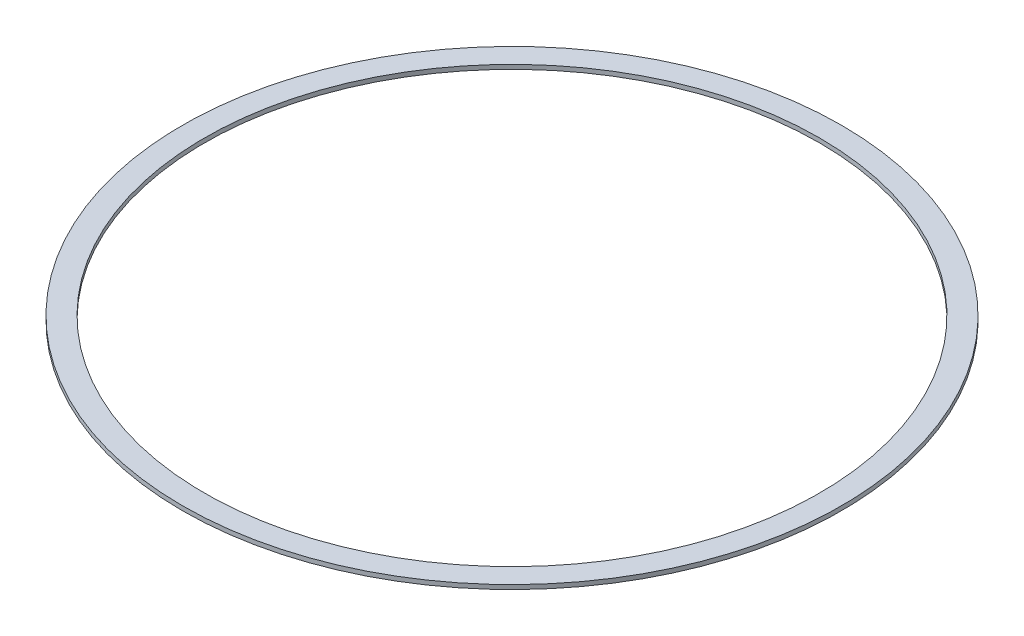
ISO-10303-21;
HEADER;
FILE_DESCRIPTION(('STEP AP214'),'2;1');
FILE_NAME('part.step','',(''),(''),'','','');
FILE_SCHEMA(('AUTOMOTIVE_DESIGN { 1 0 10303 214 1 1 1 1 }'));
ENDSEC;
DATA;
#1=APPLICATION_CONTEXT('core data for automotive mechanical design processes');
#2=APPLICATION_PROTOCOL_DEFINITION('international standard','automotive_design',2000,#1);
#3=PRODUCT_CONTEXT('',#1,'mechanical');
#4=PRODUCT('Part','Part','',(#3));
#5=PRODUCT_RELATED_PRODUCT_CATEGORY('part','',(#4));
#6=PRODUCT_DEFINITION_FORMATION('','',#4);
#7=PRODUCT_DEFINITION_CONTEXT('part definition',#1,'design');
#8=PRODUCT_DEFINITION('design','',#6,#7);
#9=PRODUCT_DEFINITION_SHAPE('','',#8);
#10=(LENGTH_UNIT() NAMED_UNIT(*) SI_UNIT(.MILLI.,.METRE.));
#11=(NAMED_UNIT(*) PLANE_ANGLE_UNIT() SI_UNIT($,.RADIAN.));
#12=(NAMED_UNIT(*) SI_UNIT($,.STERADIAN.) SOLID_ANGLE_UNIT());
#13=UNCERTAINTY_MEASURE_WITH_UNIT(LENGTH_MEASURE(1.E-05),#10,'distance_accuracy_value','');
#14=(GEOMETRIC_REPRESENTATION_CONTEXT(3) GLOBAL_UNCERTAINTY_ASSIGNED_CONTEXT((#13)) GLOBAL_UNIT_ASSIGNED_CONTEXT((#10,
#11,#12)) REPRESENTATION_CONTEXT('',''));
#15=CARTESIAN_POINT('',(0.,0.,0.));
#16=DIRECTION('',(0.,0.,1.));
#17=DIRECTION('',(1.,0.,0.));
#18=AXIS2_PLACEMENT_3D('',#15,#16,#17);
#19=CARTESIAN_POINT('',(76.2,23.4343101606121,0.));
#20=DIRECTION('',(0.,1.,0.));
#21=DIRECTION('',(0.,0.,1.));
#22=AXIS2_PLACEMENT_3D('',#19,#20,#21);
#23=PLANE('',#22);
#24=CARTESIAN_POINT('',(0.,23.4343101606121,0.));
#25=DIRECTION('',(0.,-1.,0.));
#26=DIRECTION('',(0.,0.,-1.));
#27=AXIS2_PLACEMENT_3D('',#24,#25,#26);
#28=CIRCLE('',#27,71.12);
#29=CARTESIAN_POINT('',(0.,23.4343101606121,-71.12));
#30=VERTEX_POINT('',#29);
#31=EDGE_CURVE('E10',#30,#30,#28,.T.);
#32=ORIENTED_EDGE('',*,*,#31,.T.);
#33=EDGE_LOOP('',(#32));
#34=FACE_BOUND('',#33,.T.);
#35=CARTESIAN_POINT('',(0.,23.4343101606121,0.));
#36=DIRECTION('',(0.,-1.,0.));
#37=DIRECTION('',(0.,0.,-1.));
#38=AXIS2_PLACEMENT_3D('',#35,#36,#37);
#39=CIRCLE('',#38,76.2);
#40=CARTESIAN_POINT('',(0.,23.4343101606121,-76.2));
#41=VERTEX_POINT('',#40);
#42=EDGE_CURVE('E44',#41,#41,#39,.T.);
#43=ORIENTED_EDGE('',*,*,#42,.F.);
#44=EDGE_LOOP('',(#43));
#45=FACE_BOUND('',#44,.T.);
#46=ADVANCED_FACE('F30',(#34,#45),#23,.T.);
#47=CARTESIAN_POINT('',(0.,0.,0.));
#48=DIRECTION('',(0.,-1.,0.));
#49=DIRECTION('',(0.,0.,-1.));
#50=AXIS2_PLACEMENT_3D('',#47,#48,#49);
#51=CYLINDRICAL_SURFACE('',#50,71.12);
#52=CARTESIAN_POINT('',(0.,22.4343101606121,0.));
#53=DIRECTION('',(0.,-1.,0.));
#54=DIRECTION('',(0.,0.,-1.));
#55=AXIS2_PLACEMENT_3D('',#52,#53,#54);
#56=CIRCLE('',#55,71.12);
#57=CARTESIAN_POINT('',(0.,22.4343101606121,-71.12));
#58=VERTEX_POINT('',#57);
#59=EDGE_CURVE('E36',#58,#58,#56,.T.);
#60=ORIENTED_EDGE('',*,*,#59,.T.);
#61=EDGE_LOOP('',(#60));
#62=FACE_BOUND('',#61,.T.);
#63=ORIENTED_EDGE('',*,*,#31,.F.);
#64=EDGE_LOOP('',(#63));
#65=FACE_BOUND('',#64,.T.);
#66=ADVANCED_FACE('F54',(#62,#65),#51,.F.);
#67=CARTESIAN_POINT('',(71.12,22.4343101606121,0.));
#68=DIRECTION('',(0.,-1.,0.));
#69=DIRECTION('',(0.,0.,-1.));
#70=AXIS2_PLACEMENT_3D('',#67,#68,#69);
#71=PLANE('',#70);
#72=CARTESIAN_POINT('',(0.,22.4343101606121,0.));
#73=DIRECTION('',(0.,-1.,0.));
#74=DIRECTION('',(0.,0.,-1.));
#75=AXIS2_PLACEMENT_3D('',#72,#73,#74);
#76=CIRCLE('',#75,76.2);
#77=CARTESIAN_POINT('',(0.,22.4343101606121,-76.2));
#78=VERTEX_POINT('',#77);
#79=EDGE_CURVE('E40',#78,#78,#76,.T.);
#80=ORIENTED_EDGE('',*,*,#79,.T.);
#81=EDGE_LOOP('',(#80));
#82=FACE_BOUND('',#81,.T.);
#83=ORIENTED_EDGE('',*,*,#59,.F.);
#84=EDGE_LOOP('',(#83));
#85=FACE_BOUND('',#84,.T.);
#86=ADVANCED_FACE('F58',(#82,#85),#71,.T.);
#87=CARTESIAN_POINT('',(0.,0.,0.));
#88=DIRECTION('',(0.,-1.,0.));
#89=DIRECTION('',(0.,0.,-1.));
#90=AXIS2_PLACEMENT_3D('',#87,#88,#89);
#91=CYLINDRICAL_SURFACE('',#90,76.2);
#92=ORIENTED_EDGE('',*,*,#42,.T.);
#93=EDGE_LOOP('',(#92));
#94=FACE_BOUND('',#93,.T.);
#95=ORIENTED_EDGE('',*,*,#79,.F.);
#96=EDGE_LOOP('',(#95));
#97=FACE_BOUND('',#96,.T.);
#98=ADVANCED_FACE('F50',(#94,#97),#91,.T.);
#99=CLOSED_SHELL('',(#46,#66,#86,#98));
#100=MANIFOLD_SOLID_BREP('B2',#99);
#101=ADVANCED_BREP_SHAPE_REPRESENTATION('',(#18,#100),#14);
#102=SHAPE_DEFINITION_REPRESENTATION(#9,#101);
ENDSEC;
END-ISO-10303-21;
